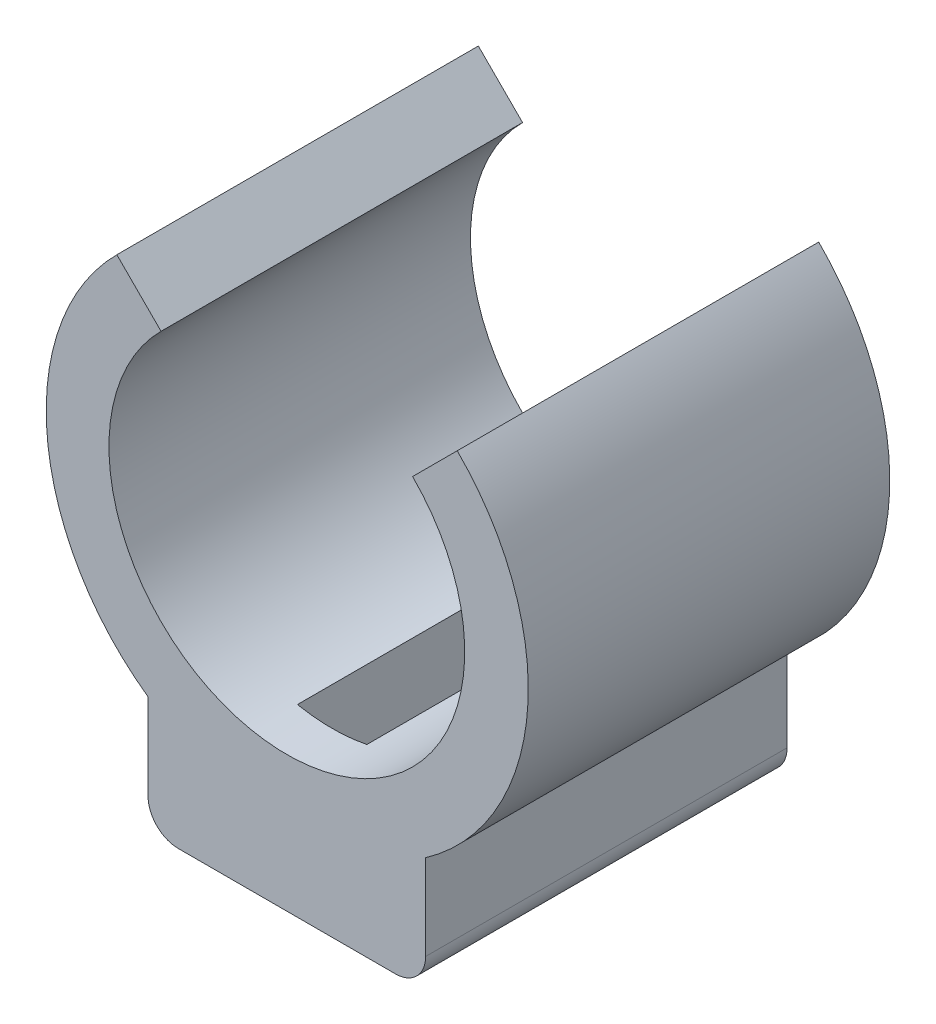
ISO-10303-21;
HEADER;
FILE_DESCRIPTION(('STEP AP214'),'2;1');
FILE_NAME('part.step','',(''),(''),'','','');
FILE_SCHEMA(('AUTOMOTIVE_DESIGN { 1 0 10303 214 1 1 1 1 }'));
ENDSEC;
DATA;
#1=APPLICATION_CONTEXT('core data for automotive mechanical design processes');
#2=APPLICATION_PROTOCOL_DEFINITION('international standard','automotive_design',2000,#1);
#3=PRODUCT_CONTEXT('',#1,'mechanical');
#4=PRODUCT('Part','Part','',(#3));
#5=PRODUCT_RELATED_PRODUCT_CATEGORY('part','',(#4));
#6=PRODUCT_DEFINITION_FORMATION('','',#4);
#7=PRODUCT_DEFINITION_CONTEXT('part definition',#1,'design');
#8=PRODUCT_DEFINITION('design','',#6,#7);
#9=PRODUCT_DEFINITION_SHAPE('','',#8);
#10=(LENGTH_UNIT() NAMED_UNIT(*) SI_UNIT(.MILLI.,.METRE.));
#11=(NAMED_UNIT(*) PLANE_ANGLE_UNIT() SI_UNIT($,.RADIAN.));
#12=(NAMED_UNIT(*) SI_UNIT($,.STERADIAN.) SOLID_ANGLE_UNIT());
#13=UNCERTAINTY_MEASURE_WITH_UNIT(LENGTH_MEASURE(1.E-05),#10,'distance_accuracy_value','');
#14=(GEOMETRIC_REPRESENTATION_CONTEXT(3) GLOBAL_UNCERTAINTY_ASSIGNED_CONTEXT((#13)) GLOBAL_UNIT_ASSIGNED_CONTEXT((#10,
#11,#12)) REPRESENTATION_CONTEXT('',''));
#15=CARTESIAN_POINT('',(0.,0.,0.));
#16=DIRECTION('',(0.,0.,1.));
#17=DIRECTION('',(1.,0.,0.));
#18=AXIS2_PLACEMENT_3D('',#15,#16,#17);
#19=CARTESIAN_POINT('',(2.875,-0.2,0.800181514904293));
#20=DIRECTION('',(0.,0.,1.));
#21=DIRECTION('',(1.,0.,0.));
#22=AXIS2_PLACEMENT_3D('',#19,#20,#21);
#23=PLANE('',#22);
#24=DIRECTION('',(0.,1.,0.));
#25=VECTOR('',#24,1.);
#26=CARTESIAN_POINT('',(-1.72770148689447,-0.2,0.800181514904293));
#27=LINE('',#26,#25);
#28=CARTESIAN_POINT('',(-1.72770148689447,0.3,0.800181514904293));
#29=VERTEX_POINT('',#28);
#30=CARTESIAN_POINT('',(-1.72770148689447,1.72839168525977,0.800181514904293));
#31=VERTEX_POINT('',#30);
#32=EDGE_CURVE('E252',#29,#31,#27,.T.);
#33=ORIENTED_EDGE('',*,*,#32,.F.);
#34=CARTESIAN_POINT('',(-1.22770148689447,0.3,0.800181514904293));
#35=DIRECTION('',(0.,0.,1.));
#36=DIRECTION('',(1.,0.,0.));
#37=AXIS2_PLACEMENT_3D('',#34,#35,#36);
#38=CIRCLE('',#37,0.5);
#39=CARTESIAN_POINT('',(-1.22770148689447,-0.2,0.800181514904293));
#40=VERTEX_POINT('',#39);
#41=EDGE_CURVE('E269',#29,#40,#38,.T.);
#42=ORIENTED_EDGE('',*,*,#41,.T.);
#43=DIRECTION('',(1.,0.,0.));
#44=VECTOR('',#43,1.);
#45=CARTESIAN_POINT('',(2.875,-0.2,0.800181514904293));
#46=LINE('',#45,#44);
#47=CARTESIAN_POINT('',(2.375,-0.2,0.800181514904293));
#48=VERTEX_POINT('',#47);
#49=EDGE_CURVE('E245',#40,#48,#46,.T.);
#50=ORIENTED_EDGE('',*,*,#49,.T.);
#51=CARTESIAN_POINT('',(2.375,0.3,0.800181514904293));
#52=DIRECTION('',(0.,0.,1.));
#53=DIRECTION('',(1.,0.,0.));
#54=AXIS2_PLACEMENT_3D('',#51,#52,#53);
#55=CIRCLE('',#54,0.5);
#56=CARTESIAN_POINT('',(2.875,0.3,0.800181514904293));
#57=VERTEX_POINT('',#56);
#58=EDGE_CURVE('E267',#48,#57,#55,.T.);
#59=ORIENTED_EDGE('',*,*,#58,.T.);
#60=DIRECTION('',(0.,1.,0.));
#61=VECTOR('',#60,1.);
#62=CARTESIAN_POINT('',(2.875,-0.2,0.800181514904293));
#63=LINE('',#62,#61);
#64=CARTESIAN_POINT('',(2.875,1.71874820159352,0.800181514904293));
#65=VERTEX_POINT('',#64);
#66=EDGE_CURVE('E251',#57,#65,#63,.T.);
#67=ORIENTED_EDGE('',*,*,#66,.T.);
#68=CARTESIAN_POINT('',(0.580497055797368,4.99192989050579,0.800181514904293));
#69=DIRECTION('',(0.,0.,1.));
#70=DIRECTION('',(1.,0.,0.));
#71=AXIS2_PLACEMENT_3D('',#68,#69,#70);
#72=CIRCLE('',#71,3.99730685957247);
#73=CARTESIAN_POINT('',(3.39955104652344,7.82590178997067,0.800181514904293));
#74=VERTEX_POINT('',#73);
#75=EDGE_CURVE('E210',#65,#74,#72,.T.);
#76=ORIENTED_EDGE('',*,*,#75,.T.);
#77=DIRECTION('',(-0.707106781186548,-0.707106781186547,0.));
#78=VECTOR('',#77,1.);
#79=CARTESIAN_POINT('',(3.39955104652344,7.82590178997067,0.800181514904293));
#80=LINE('',#79,#78);
#81=CARTESIAN_POINT('',(2.65961426105308,7.08596500450031,0.800181514904293));
#82=VERTEX_POINT('',#81);
#83=EDGE_CURVE('E203',#74,#82,#80,.T.);
#84=ORIENTED_EDGE('',*,*,#83,.T.);
#85=CARTESIAN_POINT('',(0.573649256552765,5.,0.800181514904293));
#86=DIRECTION('',(0.,0.,-1.));
#87=DIRECTION('',(1.,0.,0.));
#88=AXIS2_PLACEMENT_3D('',#85,#86,#87);
#89=CIRCLE('',#88,2.95);
#90=CARTESIAN_POINT('',(-1.51231574794755,7.08596500450032,0.800181514904293));
#91=VERTEX_POINT('',#90);
#92=EDGE_CURVE('E202',#82,#91,#89,.T.);
#93=ORIENTED_EDGE('',*,*,#92,.T.);
#94=DIRECTION('',(-0.707106781186547,0.707106781186548,0.));
#95=VECTOR('',#94,1.);
#96=CARTESIAN_POINT('',(-2.24541450989257,7.81906376644534,0.800181514904293));
#97=LINE('',#96,#95);
#98=CARTESIAN_POINT('',(-2.24541450989257,7.81906376644534,0.800181514904293));
#99=VERTEX_POINT('',#98);
#100=EDGE_CURVE('E211',#91,#99,#97,.T.);
#101=ORIENTED_EDGE('',*,*,#100,.T.);
#102=EDGE_CURVE('E207',#99,#31,#72,.T.);
#103=ORIENTED_EDGE('',*,*,#102,.T.);
#104=EDGE_LOOP('',(#33,#42,#50,#59,#67,#76,#84,#93,#101,#103));
#105=FACE_BOUND('',#104,.T.);
#106=ADVANCED_FACE('F34',(#105),#23,.T.);
#107=CARTESIAN_POINT('',(-1.72770148689447,-0.2,-5.1952912406683));
#108=DIRECTION('',(-1.,0.,0.));
#109=DIRECTION('',(0.,0.,1.));
#110=AXIS2_PLACEMENT_3D('',#107,#108,#109);
#111=PLANE('',#110);
#112=DIRECTION('',(0.,1.,0.));
#113=VECTOR('',#112,1.);
#114=CARTESIAN_POINT('',(-1.72770148689447,-0.2,-5.1952912406683));
#115=LINE('',#114,#113);
#116=CARTESIAN_POINT('',(-1.72770148689447,0.3,-5.1952912406683));
#117=VERTEX_POINT('',#116);
#118=CARTESIAN_POINT('',(-1.72770148689447,1.72839168525977,-5.1952912406683));
#119=VERTEX_POINT('',#118);
#120=EDGE_CURVE('E254',#117,#119,#115,.T.);
#121=ORIENTED_EDGE('',*,*,#120,.F.);
#122=DIRECTION('',(0.,0.,1.));
#123=VECTOR('',#122,1.);
#124=CARTESIAN_POINT('',(-1.72770148689447,0.3,0.800181514904293));
#125=LINE('',#124,#123);
#126=EDGE_CURVE('E264',#117,#29,#125,.T.);
#127=ORIENTED_EDGE('',*,*,#126,.T.);
#128=ORIENTED_EDGE('',*,*,#32,.T.);
#129=DIRECTION('',(0.,0.,1.));
#130=VECTOR('',#129,1.);
#131=CARTESIAN_POINT('',(-1.72770148689447,1.72839168525977,-15.7110041505007));
#132=LINE('',#131,#130);
#133=EDGE_CURVE('E240',#119,#31,#132,.T.);
#134=ORIENTED_EDGE('',*,*,#133,.F.);
#135=EDGE_LOOP('',(#121,#127,#128,#134));
#136=FACE_BOUND('',#135,.T.);
#137=ADVANCED_FACE('F354',(#136),#111,.T.);
#138=CARTESIAN_POINT('',(-1.72770148689447,-0.2,-5.1952912406683));
#139=DIRECTION('',(0.,0.,-1.));
#140=DIRECTION('',(-1.,0.,0.));
#141=AXIS2_PLACEMENT_3D('',#138,#139,#140);
#142=PLANE('',#141);
#143=DIRECTION('',(-1.,0.,0.));
#144=VECTOR('',#143,1.);
#145=CARTESIAN_POINT('',(-1.72770148689447,-0.2,-5.1952912406683));
#146=LINE('',#145,#144);
#147=CARTESIAN_POINT('',(2.375,-0.2,-5.1952912406683));
#148=VERTEX_POINT('',#147);
#149=CARTESIAN_POINT('',(-1.22770148689447,-0.2,-5.1952912406683));
#150=VERTEX_POINT('',#149);
#151=EDGE_CURVE('E248',#148,#150,#146,.T.);
#152=ORIENTED_EDGE('',*,*,#151,.T.);
#153=CARTESIAN_POINT('',(-1.22770148689447,0.3,-5.1952912406683));
#154=DIRECTION('',(0.,0.,-1.));
#155=DIRECTION('',(-1.,0.,0.));
#156=AXIS2_PLACEMENT_3D('',#153,#154,#155);
#157=CIRCLE('',#156,0.5);
#158=EDGE_CURVE('E277',#150,#117,#157,.T.);
#159=ORIENTED_EDGE('',*,*,#158,.T.);
#160=ORIENTED_EDGE('',*,*,#120,.T.);
#161=CARTESIAN_POINT('',(0.580497055797368,4.99192989050579,-5.1952912406683));
#162=DIRECTION('',(0.,0.,-1.));
#163=DIRECTION('',(-1.,0.,0.));
#164=AXIS2_PLACEMENT_3D('',#161,#162,#163);
#165=CIRCLE('',#164,3.99730685957247);
#166=CARTESIAN_POINT('',(-2.24541450989257,7.81906376644534,-5.1952912406683));
#167=VERTEX_POINT('',#166);
#168=EDGE_CURVE('E228',#167,#119,#165,.F.);
#169=ORIENTED_EDGE('',*,*,#168,.F.);
#170=DIRECTION('',(-0.707106781186547,0.707106781186548,0.));
#171=VECTOR('',#170,1.);
#172=CARTESIAN_POINT('',(-2.24541450989257,7.81906376644534,-5.1952912406683));
#173=LINE('',#172,#171);
#174=CARTESIAN_POINT('',(-1.51231574794755,7.08596500450032,-5.1952912406683));
#175=VERTEX_POINT('',#174);
#176=EDGE_CURVE('E206',#175,#167,#173,.T.);
#177=ORIENTED_EDGE('',*,*,#176,.F.);
#178=CARTESIAN_POINT('',(0.573649256552765,5.,-5.1952912406683));
#179=DIRECTION('',(0.,0.,-1.));
#180=DIRECTION('',(-1.,0.,0.));
#181=AXIS2_PLACEMENT_3D('',#178,#179,#180);
#182=CIRCLE('',#181,2.95);
#183=CARTESIAN_POINT('',(2.65961426105308,7.08596500450031,-5.1952912406683));
#184=VERTEX_POINT('',#183);
#185=EDGE_CURVE('E219',#184,#175,#182,.T.);
#186=ORIENTED_EDGE('',*,*,#185,.F.);
#187=DIRECTION('',(-0.707106781186548,-0.707106781186547,0.));
#188=VECTOR('',#187,1.);
#189=CARTESIAN_POINT('',(3.39955104652344,7.82590178997067,-5.1952912406683));
#190=LINE('',#189,#188);
#191=CARTESIAN_POINT('',(3.39955104652344,7.82590178997067,-5.1952912406683));
#192=VERTEX_POINT('',#191);
#193=EDGE_CURVE('E224',#192,#184,#190,.T.);
#194=ORIENTED_EDGE('',*,*,#193,.F.);
#195=CARTESIAN_POINT('',(2.875,1.71874820159352,-5.1952912406683));
#196=VERTEX_POINT('',#195);
#197=EDGE_CURVE('E231',#196,#192,#165,.F.);
#198=ORIENTED_EDGE('',*,*,#197,.F.);
#199=DIRECTION('',(0.,1.,0.));
#200=VECTOR('',#199,1.);
#201=CARTESIAN_POINT('',(2.875,-0.2,-5.1952912406683));
#202=LINE('',#201,#200);
#203=CARTESIAN_POINT('',(2.875,0.3,-5.1952912406683));
#204=VERTEX_POINT('',#203);
#205=EDGE_CURVE('E256',#204,#196,#202,.T.);
#206=ORIENTED_EDGE('',*,*,#205,.F.);
#207=CARTESIAN_POINT('',(2.375,0.3,-5.1952912406683));
#208=DIRECTION('',(0.,0.,-1.));
#209=DIRECTION('',(-1.,0.,0.));
#210=AXIS2_PLACEMENT_3D('',#207,#208,#209);
#211=CIRCLE('',#210,0.5);
#212=EDGE_CURVE('E275',#204,#148,#211,.T.);
#213=ORIENTED_EDGE('',*,*,#212,.T.);
#214=EDGE_LOOP('',(#152,#159,#160,#169,#177,#186,#194,#198,#206,#213));
#215=FACE_BOUND('',#214,.T.);
#216=ADVANCED_FACE('F321',(#215),#142,.T.);
#217=CARTESIAN_POINT('',(2.875,-0.2,-5.1952912406683));
#218=DIRECTION('',(1.,0.,0.));
#219=DIRECTION('',(0.,0.,-1.));
#220=AXIS2_PLACEMENT_3D('',#217,#218,#219);
#221=PLANE('',#220);
#222=ORIENTED_EDGE('',*,*,#66,.F.);
#223=DIRECTION('',(0.,0.,-1.));
#224=VECTOR('',#223,1.);
#225=CARTESIAN_POINT('',(2.875,0.3,-5.1952912406683));
#226=LINE('',#225,#224);
#227=EDGE_CURVE('E279',#57,#204,#226,.T.);
#228=ORIENTED_EDGE('',*,*,#227,.T.);
#229=ORIENTED_EDGE('',*,*,#205,.T.);
#230=DIRECTION('',(0.,0.,1.));
#231=VECTOR('',#230,1.);
#232=CARTESIAN_POINT('',(2.875,1.71874820159352,-15.7110041505007));
#233=LINE('',#232,#231);
#234=EDGE_CURVE('E237',#65,#196,#233,.F.);
#235=ORIENTED_EDGE('',*,*,#234,.F.);
#236=EDGE_LOOP('',(#222,#228,#229,#235));
#237=FACE_BOUND('',#236,.T.);
#238=ADVANCED_FACE('F336',(#237),#221,.T.);
#239=CARTESIAN_POINT('',(0.,-0.2,0.));
#240=DIRECTION('',(0.,1.,0.));
#241=DIRECTION('',(0.,0.,1.));
#242=AXIS2_PLACEMENT_3D('',#239,#240,#241);
#243=PLANE('',#242);
#244=DIRECTION('',(1.,0.,0.));
#245=VECTOR('',#244,1.);
#246=CARTESIAN_POINT('',(0.,-0.2,-4.68284271247462));
#247=LINE('',#246,#245);
#248=CARTESIAN_POINT('',(1.15,-0.2,-4.68284271247462));
#249=VERTEX_POINT('',#248);
#250=CARTESIAN_POINT('',(0.,-0.2,-4.68284271247462));
#251=VERTEX_POINT('',#250);
#252=EDGE_CURVE('E284',#249,#251,#247,.F.);
#253=ORIENTED_EDGE('',*,*,#252,.T.);
#254=DIRECTION('',(0.,0.,1.));
#255=VECTOR('',#254,1.);
#256=CARTESIAN_POINT('',(0.,-0.2,0.));
#257=LINE('',#256,#255);
#258=CARTESIAN_POINT('',(0.,-0.2,0.282842712474619));
#259=VERTEX_POINT('',#258);
#260=EDGE_CURVE('E48',#251,#259,#257,.T.);
#261=ORIENTED_EDGE('',*,*,#260,.T.);
#262=DIRECTION('',(-1.,0.,0.));
#263=VECTOR('',#262,1.);
#264=CARTESIAN_POINT('',(0.,-0.2,0.282842712474619));
#265=LINE('',#264,#263);
#266=CARTESIAN_POINT('',(1.15,-0.2,0.282842712474619));
#267=VERTEX_POINT('',#266);
#268=EDGE_CURVE('E282',#259,#267,#265,.F.);
#269=ORIENTED_EDGE('',*,*,#268,.T.);
#270=DIRECTION('',(0.,0.,-1.));
#271=VECTOR('',#270,1.);
#272=CARTESIAN_POINT('',(1.15,-0.2,0.));
#273=LINE('',#272,#271);
#274=EDGE_CURVE('E56',#267,#249,#273,.T.);
#275=ORIENTED_EDGE('',*,*,#274,.T.);
#276=EDGE_LOOP('',(#253,#261,#269,#275));
#277=FACE_BOUND('',#276,.T.);
#278=ORIENTED_EDGE('',*,*,#49,.F.);
#279=DIRECTION('',(0.,0.,1.));
#280=VECTOR('',#279,1.);
#281=CARTESIAN_POINT('',(-1.22770148689447,-0.2,-5.1952912406683));
#282=LINE('',#281,#280);
#283=EDGE_CURVE('E273',#40,#150,#282,.F.);
#284=ORIENTED_EDGE('',*,*,#283,.T.);
#285=ORIENTED_EDGE('',*,*,#151,.F.);
#286=DIRECTION('',(0.,0.,-1.));
#287=VECTOR('',#286,1.);
#288=CARTESIAN_POINT('',(2.375,-0.2,0.800181514904293));
#289=LINE('',#288,#287);
#290=EDGE_CURVE('E271',#148,#48,#289,.F.);
#291=ORIENTED_EDGE('',*,*,#290,.T.);
#292=EDGE_LOOP('',(#278,#284,#285,#291));
#293=FACE_BOUND('',#292,.T.);
#294=ADVANCED_FACE('F344',(#277,#293),#243,.F.);
#295=CARTESIAN_POINT('',(0.,-0.2,0.));
#296=DIRECTION('',(-1.,0.,0.));
#297=DIRECTION('',(0.,0.,1.));
#298=AXIS2_PLACEMENT_3D('',#295,#296,#297);
#299=PLANE('',#298);
#300=DIRECTION('',(0.,0.,-1.));
#301=VECTOR('',#300,1.);
#302=CARTESIAN_POINT('',(0.,0.,-4.45));
#303=LINE('',#302,#301);
#304=CARTESIAN_POINT('',(0.,0.,0.0499999999999994));
#305=VERTEX_POINT('',#304);
#306=CARTESIAN_POINT('',(0.,0.,0.));
#307=VERTEX_POINT('',#306);
#308=EDGE_CURVE('E177',#305,#307,#303,.T.);
#309=ORIENTED_EDGE('',*,*,#308,.T.);
#310=CARTESIAN_POINT('',(0.,0.1,0.282842712474619));
#311=DIRECTION('',(-1.,0.,0.));
#312=DIRECTION('',(0.,0.,1.));
#313=AXIS2_PLACEMENT_3D('',#310,#311,#312);
#314=CIRCLE('',#313,0.3);
#315=EDGE_CURVE('E11',#307,#259,#314,.T.);
#316=ORIENTED_EDGE('',*,*,#315,.T.);
#317=ORIENTED_EDGE('',*,*,#260,.F.);
#318=CARTESIAN_POINT('',(0.,0.1,-4.68284271247462));
#319=DIRECTION('',(-1.,0.,0.));
#320=DIRECTION('',(0.,0.,1.));
#321=AXIS2_PLACEMENT_3D('',#318,#319,#320);
#322=CIRCLE('',#321,0.3);
#323=CARTESIAN_POINT('',(0.,0.,-4.4));
#324=VERTEX_POINT('',#323);
#325=EDGE_CURVE('E174',#251,#324,#322,.T.);
#326=ORIENTED_EDGE('',*,*,#325,.T.);
#327=CARTESIAN_POINT('',(0.,0.,-4.45));
#328=VERTEX_POINT('',#327);
#329=EDGE_CURVE('E171',#324,#328,#303,.T.);
#330=ORIENTED_EDGE('',*,*,#329,.T.);
#331=DIRECTION('',(0.,-1.,0.));
#332=VECTOR('',#331,1.);
#333=CARTESIAN_POINT('',(0.,2.2,-4.45));
#334=LINE('',#333,#332);
#335=CARTESIAN_POINT('',(0.,2.10631264120388,-4.45));
#336=VERTEX_POINT('',#335);
#337=EDGE_CURVE('E159',#336,#328,#334,.T.);
#338=ORIENTED_EDGE('',*,*,#337,.F.);
#339=DIRECTION('',(0.,0.,1.));
#340=VECTOR('',#339,1.);
#341=CARTESIAN_POINT('',(0.,2.10631264120388,-15.7110041505007));
#342=LINE('',#341,#340);
#343=CARTESIAN_POINT('',(0.,2.10631264120388,0.049999999999998));
#344=VERTEX_POINT('',#343);
#345=EDGE_CURVE('E198',#336,#344,#342,.T.);
#346=ORIENTED_EDGE('',*,*,#345,.T.);
#347=DIRECTION('',(0.,-1.,0.));
#348=VECTOR('',#347,1.);
#349=CARTESIAN_POINT('',(0.,2.2,0.0499999999999994));
#350=LINE('',#349,#348);
#351=EDGE_CURVE('E190',#344,#305,#350,.T.);
#352=ORIENTED_EDGE('',*,*,#351,.T.);
#353=EDGE_LOOP('',(#309,#316,#317,#326,#330,#338,#346,#352));
#354=FACE_BOUND('',#353,.T.);
#355=ADVANCED_FACE('F173',(#354),#299,.F.);
#356=CARTESIAN_POINT('',(1.15,-0.2,0.));
#357=DIRECTION('',(1.,0.,0.));
#358=DIRECTION('',(0.,0.,-1.));
#359=AXIS2_PLACEMENT_3D('',#356,#357,#358);
#360=PLANE('',#359);
#361=DIRECTION('',(0.,0.,1.));
#362=VECTOR('',#361,1.);
#363=CARTESIAN_POINT('',(1.15,0.,-4.45));
#364=LINE('',#363,#362);
#365=CARTESIAN_POINT('',(1.15,0.,-4.45));
#366=VERTEX_POINT('',#365);
#367=CARTESIAN_POINT('',(1.15,0.,-4.4));
#368=VERTEX_POINT('',#367);
#369=EDGE_CURVE('E182',#366,#368,#364,.T.);
#370=ORIENTED_EDGE('',*,*,#369,.T.);
#371=CARTESIAN_POINT('',(1.15,0.1,-4.68284271247462));
#372=DIRECTION('',(1.,0.,0.));
#373=DIRECTION('',(0.,0.,-1.));
#374=AXIS2_PLACEMENT_3D('',#371,#372,#373);
#375=CIRCLE('',#374,0.3);
#376=EDGE_CURVE('E287',#368,#249,#375,.T.);
#377=ORIENTED_EDGE('',*,*,#376,.T.);
#378=ORIENTED_EDGE('',*,*,#274,.F.);
#379=CARTESIAN_POINT('',(1.15,0.1,0.282842712474619));
#380=DIRECTION('',(1.,0.,0.));
#381=DIRECTION('',(0.,0.,-1.));
#382=AXIS2_PLACEMENT_3D('',#379,#380,#381);
#383=CIRCLE('',#382,0.3);
#384=CARTESIAN_POINT('',(1.15,0.,0.));
#385=VERTEX_POINT('',#384);
#386=EDGE_CURVE('E42',#267,#385,#383,.T.);
#387=ORIENTED_EDGE('',*,*,#386,.T.);
#388=CARTESIAN_POINT('',(1.15,0.,0.0499999999999994));
#389=VERTEX_POINT('',#388);
#390=EDGE_CURVE('E183',#385,#389,#364,.T.);
#391=ORIENTED_EDGE('',*,*,#390,.T.);
#392=DIRECTION('',(0.,-1.,0.));
#393=VECTOR('',#392,1.);
#394=CARTESIAN_POINT('',(1.15,2.2,0.0499999999999994));
#395=LINE('',#394,#393);
#396=CARTESIAN_POINT('',(1.15,2.10684949915705,0.0499999999999994));
#397=VERTEX_POINT('',#396);
#398=EDGE_CURVE('E193',#397,#389,#395,.T.);
#399=ORIENTED_EDGE('',*,*,#398,.F.);
#400=DIRECTION('',(0.,0.,1.));
#401=VECTOR('',#400,1.);
#402=CARTESIAN_POINT('',(1.15,2.10684949915705,-15.7110041505007));
#403=LINE('',#402,#401);
#404=CARTESIAN_POINT('',(1.15,2.10684949915705,-4.45));
#405=VERTEX_POINT('',#404);
#406=EDGE_CURVE('E192',#397,#405,#403,.F.);
#407=ORIENTED_EDGE('',*,*,#406,.T.);
#408=DIRECTION('',(0.,-1.,0.));
#409=VECTOR('',#408,1.);
#410=CARTESIAN_POINT('',(1.15,2.2,-4.45));
#411=LINE('',#410,#409);
#412=EDGE_CURVE('E167',#405,#366,#411,.T.);
#413=ORIENTED_EDGE('',*,*,#412,.T.);
#414=EDGE_LOOP('',(#370,#377,#378,#387,#391,#399,#407,#413));
#415=FACE_BOUND('',#414,.T.);
#416=ADVANCED_FACE('F291',(#415),#360,.F.);
#417=CARTESIAN_POINT('',(0.573649256552765,5.,-15.7110041505007));
#418=DIRECTION('',(0.,0.,1.));
#419=DIRECTION('',(1.,0.,0.));
#420=AXIS2_PLACEMENT_3D('',#417,#418,#419);
#421=CYLINDRICAL_SURFACE('',#420,2.95);
#422=ORIENTED_EDGE('',*,*,#345,.F.);
#423=CARTESIAN_POINT('',(0.573649256552765,5.,-4.45));
#424=DIRECTION('',(0.,0.,-1.));
#425=DIRECTION('',(-1.,0.,0.));
#426=AXIS2_PLACEMENT_3D('',#423,#424,#425);
#427=CIRCLE('',#426,2.95);
#428=EDGE_CURVE('E165',#405,#336,#427,.T.);
#429=ORIENTED_EDGE('',*,*,#428,.F.);
#430=ORIENTED_EDGE('',*,*,#406,.F.);
#431=CARTESIAN_POINT('',(0.573649256552765,5.,0.049999999999998));
#432=DIRECTION('',(0.,0.,1.));
#433=DIRECTION('',(1.,0.,0.));
#434=AXIS2_PLACEMENT_3D('',#431,#432,#433);
#435=CIRCLE('',#434,2.95);
#436=EDGE_CURVE('E260',#344,#397,#435,.T.);
#437=ORIENTED_EDGE('',*,*,#436,.F.);
#438=EDGE_LOOP('',(#422,#429,#430,#437));
#439=FACE_BOUND('',#438,.T.);
#440=DIRECTION('',(0.,0.,1.));
#441=VECTOR('',#440,1.);
#442=CARTESIAN_POINT('',(2.65961426105308,7.08596500450031,-15.7110041505007));
#443=LINE('',#442,#441);
#444=EDGE_CURVE('E223',#184,#82,#443,.T.);
#445=ORIENTED_EDGE('',*,*,#444,.F.);
#446=ORIENTED_EDGE('',*,*,#185,.T.);
#447=DIRECTION('',(0.,0.,1.));
#448=VECTOR('',#447,1.);
#449=CARTESIAN_POINT('',(-1.51231574794755,7.08596500450032,-15.7110041505007));
#450=LINE('',#449,#448);
#451=EDGE_CURVE('E222',#175,#91,#450,.T.);
#452=ORIENTED_EDGE('',*,*,#451,.T.);
#453=ORIENTED_EDGE('',*,*,#92,.F.);
#454=EDGE_LOOP('',(#445,#446,#452,#453));
#455=FACE_BOUND('',#454,.T.);
#456=ADVANCED_FACE('F307',(#439,#455),#421,.F.);
#457=CARTESIAN_POINT('',(3.39955104652344,7.82590178997067,-15.7110041505007));
#458=DIRECTION('',(-0.707106781186547,0.707106781186548,0.));
#459=DIRECTION('',(-0.707106781186548,-0.707106781186547,0.));
#460=AXIS2_PLACEMENT_3D('',#457,#458,#459);
#461=PLANE('',#460);
#462=DIRECTION('',(0.,0.,1.));
#463=VECTOR('',#462,1.);
#464=CARTESIAN_POINT('',(3.39955104652344,7.82590178997067,-15.7110041505007));
#465=LINE('',#464,#463);
#466=EDGE_CURVE('E227',#192,#74,#465,.T.);
#467=ORIENTED_EDGE('',*,*,#466,.F.);
#468=ORIENTED_EDGE('',*,*,#193,.T.);
#469=ORIENTED_EDGE('',*,*,#444,.T.);
#470=ORIENTED_EDGE('',*,*,#83,.F.);
#471=EDGE_LOOP('',(#467,#468,#469,#470));
#472=FACE_BOUND('',#471,.T.);
#473=ADVANCED_FACE('F310',(#472),#461,.T.);
#474=CARTESIAN_POINT('',(0.580497055797368,4.99192989050579,-15.7110041505007));
#475=DIRECTION('',(0.,0.,1.));
#476=DIRECTION('',(1.,0.,0.));
#477=AXIS2_PLACEMENT_3D('',#474,#475,#476);
#478=CYLINDRICAL_SURFACE('',#477,3.99730685957247);
#479=ORIENTED_EDGE('',*,*,#75,.F.);
#480=ORIENTED_EDGE('',*,*,#234,.T.);
#481=ORIENTED_EDGE('',*,*,#197,.T.);
#482=ORIENTED_EDGE('',*,*,#466,.T.);
#483=EDGE_LOOP('',(#479,#480,#481,#482));
#484=FACE_BOUND('',#483,.T.);
#485=ADVANCED_FACE('F334',(#484),#478,.T.);
#486=CARTESIAN_POINT('',(-2.24541450989257,7.81906376644534,-15.7110041505007));
#487=DIRECTION('',(0.707106781186548,0.707106781186547,0.));
#488=DIRECTION('',(-0.707106781186547,0.707106781186548,0.));
#489=AXIS2_PLACEMENT_3D('',#486,#487,#488);
#490=PLANE('',#489);
#491=ORIENTED_EDGE('',*,*,#451,.F.);
#492=ORIENTED_EDGE('',*,*,#176,.T.);
#493=DIRECTION('',(0.,0.,1.));
#494=VECTOR('',#493,1.);
#495=CARTESIAN_POINT('',(-2.24541450989257,7.81906376644534,-15.7110041505007));
#496=LINE('',#495,#494);
#497=EDGE_CURVE('E218',#167,#99,#496,.T.);
#498=ORIENTED_EDGE('',*,*,#497,.T.);
#499=ORIENTED_EDGE('',*,*,#100,.F.);
#500=EDGE_LOOP('',(#491,#492,#498,#499));
#501=FACE_BOUND('',#500,.T.);
#502=ADVANCED_FACE('F325',(#501),#490,.T.);
#503=ORIENTED_EDGE('',*,*,#168,.T.);
#504=ORIENTED_EDGE('',*,*,#133,.T.);
#505=ORIENTED_EDGE('',*,*,#102,.F.);
#506=ORIENTED_EDGE('',*,*,#497,.F.);
#507=EDGE_LOOP('',(#503,#504,#505,#506));
#508=FACE_BOUND('',#507,.T.);
#509=ADVANCED_FACE('F356',(#508),#478,.T.);
#510=CARTESIAN_POINT('',(0.,0.,0.));
#511=DIRECTION('',(0.,1.,0.));
#512=DIRECTION('',(0.,0.,1.));
#513=AXIS2_PLACEMENT_3D('',#510,#511,#512);
#514=PLANE('',#513);
#515=DIRECTION('',(1.,0.,0.));
#516=VECTOR('',#515,1.);
#517=CARTESIAN_POINT('',(0.,0.,-4.4));
#518=LINE('',#517,#516);
#519=EDGE_CURVE('E200',#324,#368,#518,.T.);
#520=ORIENTED_EDGE('',*,*,#519,.T.);
#521=ORIENTED_EDGE('',*,*,#369,.F.);
#522=DIRECTION('',(1.,0.,0.));
#523=VECTOR('',#522,1.);
#524=CARTESIAN_POINT('',(0.,0.,-4.45));
#525=LINE('',#524,#523);
#526=EDGE_CURVE('E163',#328,#366,#525,.T.);
#527=ORIENTED_EDGE('',*,*,#526,.F.);
#528=ORIENTED_EDGE('',*,*,#329,.F.);
#529=EDGE_LOOP('',(#520,#521,#527,#528));
#530=FACE_BOUND('',#529,.T.);
#531=ADVANCED_FACE('F180',(#530),#514,.T.);
#532=DIRECTION('',(-1.,0.,0.));
#533=VECTOR('',#532,1.);
#534=CARTESIAN_POINT('',(0.,0.,0.));
#535=LINE('',#534,#533);
#536=EDGE_CURVE('E262',#385,#307,#535,.T.);
#537=ORIENTED_EDGE('',*,*,#536,.T.);
#538=ORIENTED_EDGE('',*,*,#308,.F.);
#539=DIRECTION('',(-1.,0.,0.));
#540=VECTOR('',#539,1.);
#541=CARTESIAN_POINT('',(0.,0.,0.0499999999999994));
#542=LINE('',#541,#540);
#543=EDGE_CURVE('E168',#389,#305,#542,.T.);
#544=ORIENTED_EDGE('',*,*,#543,.F.);
#545=ORIENTED_EDGE('',*,*,#390,.F.);
#546=EDGE_LOOP('',(#537,#538,#544,#545));
#547=FACE_BOUND('',#546,.T.);
#548=ADVANCED_FACE('F298',(#547),#514,.T.);
#549=CARTESIAN_POINT('',(0.,2.2,0.0499999999999994));
#550=DIRECTION('',(0.,0.,1.));
#551=DIRECTION('',(1.,0.,0.));
#552=AXIS2_PLACEMENT_3D('',#549,#550,#551);
#553=PLANE('',#552);
#554=ORIENTED_EDGE('',*,*,#436,.T.);
#555=ORIENTED_EDGE('',*,*,#398,.T.);
#556=ORIENTED_EDGE('',*,*,#543,.T.);
#557=ORIENTED_EDGE('',*,*,#351,.F.);
#558=EDGE_LOOP('',(#554,#555,#556,#557));
#559=FACE_BOUND('',#558,.T.);
#560=ADVANCED_FACE('F303',(#559),#553,.F.);
#561=CARTESIAN_POINT('',(0.,2.2,-4.45));
#562=DIRECTION('',(0.,0.,-1.));
#563=DIRECTION('',(-1.,0.,0.));
#564=AXIS2_PLACEMENT_3D('',#561,#562,#563);
#565=PLANE('',#564);
#566=ORIENTED_EDGE('',*,*,#428,.T.);
#567=ORIENTED_EDGE('',*,*,#337,.T.);
#568=ORIENTED_EDGE('',*,*,#526,.T.);
#569=ORIENTED_EDGE('',*,*,#412,.F.);
#570=EDGE_LOOP('',(#566,#567,#568,#569));
#571=FACE_BOUND('',#570,.T.);
#572=ADVANCED_FACE('F161',(#571),#565,.F.);
#573=CARTESIAN_POINT('',(-1.22770148689447,0.3,-5.1952912406683));
#574=DIRECTION('',(0.,0.,-1.));
#575=DIRECTION('',(-1.,0.,0.));
#576=AXIS2_PLACEMENT_3D('',#573,#574,#575);
#577=CYLINDRICAL_SURFACE('',#576,0.5);
#578=ORIENTED_EDGE('',*,*,#158,.F.);
#579=ORIENTED_EDGE('',*,*,#283,.F.);
#580=ORIENTED_EDGE('',*,*,#41,.F.);
#581=ORIENTED_EDGE('',*,*,#126,.F.);
#582=EDGE_LOOP('',(#578,#579,#580,#581));
#583=FACE_BOUND('',#582,.T.);
#584=ADVANCED_FACE('F349',(#583),#577,.T.);
#585=CARTESIAN_POINT('',(2.375,0.3,-5.1952912406683));
#586=DIRECTION('',(0.,0.,1.));
#587=DIRECTION('',(1.,0.,0.));
#588=AXIS2_PLACEMENT_3D('',#585,#586,#587);
#589=CYLINDRICAL_SURFACE('',#588,0.5);
#590=ORIENTED_EDGE('',*,*,#58,.F.);
#591=ORIENTED_EDGE('',*,*,#290,.F.);
#592=ORIENTED_EDGE('',*,*,#212,.F.);
#593=ORIENTED_EDGE('',*,*,#227,.F.);
#594=EDGE_LOOP('',(#590,#591,#592,#593));
#595=FACE_BOUND('',#594,.T.);
#596=ADVANCED_FACE('F347',(#595),#589,.T.);
#597=CARTESIAN_POINT('',(0.,0.1,-4.68284271247462));
#598=DIRECTION('',(1.,0.,0.));
#599=DIRECTION('',(0.,0.,-1.));
#600=AXIS2_PLACEMENT_3D('',#597,#598,#599);
#601=CYLINDRICAL_SURFACE('',#600,0.3);
#602=ORIENTED_EDGE('',*,*,#376,.F.);
#603=ORIENTED_EDGE('',*,*,#519,.F.);
#604=ORIENTED_EDGE('',*,*,#325,.F.);
#605=ORIENTED_EDGE('',*,*,#252,.F.);
#606=EDGE_LOOP('',(#602,#603,#604,#605));
#607=FACE_BOUND('',#606,.T.);
#608=ADVANCED_FACE('F379',(#607),#601,.T.);
#609=CARTESIAN_POINT('',(0.,0.1,0.282842712474619));
#610=DIRECTION('',(-1.,0.,0.));
#611=DIRECTION('',(0.,0.,1.));
#612=AXIS2_PLACEMENT_3D('',#609,#610,#611);
#613=CYLINDRICAL_SURFACE('',#612,0.3);
#614=ORIENTED_EDGE('',*,*,#315,.F.);
#615=ORIENTED_EDGE('',*,*,#536,.F.);
#616=ORIENTED_EDGE('',*,*,#386,.F.);
#617=ORIENTED_EDGE('',*,*,#268,.F.);
#618=EDGE_LOOP('',(#614,#615,#616,#617));
#619=FACE_BOUND('',#618,.T.);
#620=ADVANCED_FACE('F36',(#619),#613,.T.);
#621=CLOSED_SHELL('',(#106,#137,#216,#238,#294,#355,#416,#456,#473,#485,#502,#509,#531,#548,
#560,#572,#584,#596,#608,#620));
#622=MANIFOLD_SOLID_BREP('B2',#621);
#623=ADVANCED_BREP_SHAPE_REPRESENTATION('',(#18,#622),#14);
#624=SHAPE_DEFINITION_REPRESENTATION(#9,#623);
ENDSEC;
END-ISO-10303-21;
